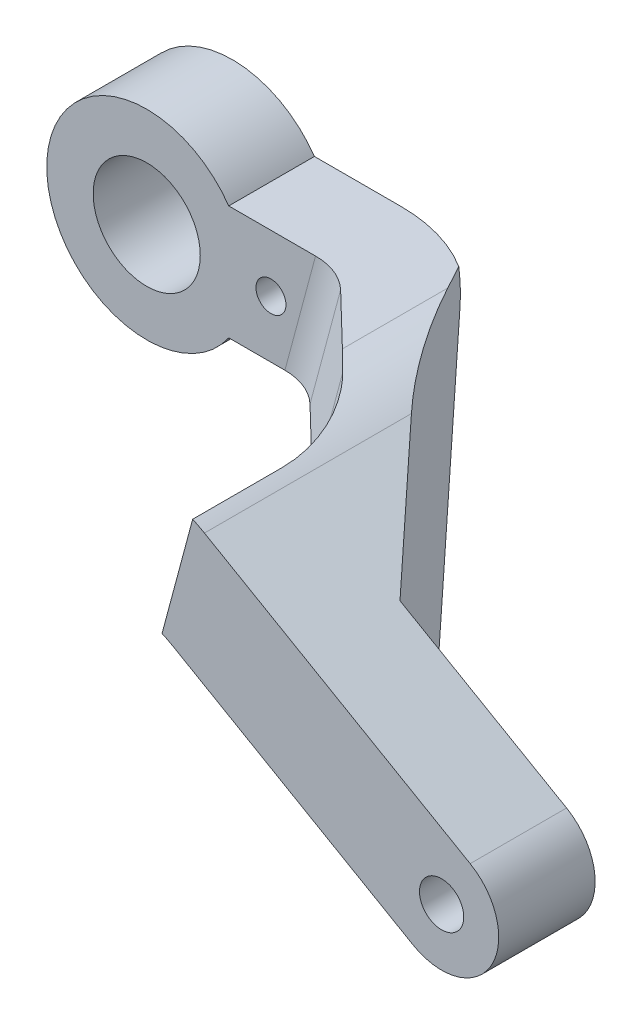
ISO-10303-21;
HEADER;
FILE_DESCRIPTION(('STEP AP214'),'2;1');
FILE_NAME('part.step','',(''),(''),'','','');
FILE_SCHEMA(('AUTOMOTIVE_DESIGN { 1 0 10303 214 1 1 1 1 }'));
ENDSEC;
DATA;
#1=APPLICATION_CONTEXT('core data for automotive mechanical design processes');
#2=APPLICATION_PROTOCOL_DEFINITION('international standard','automotive_design',2000,#1);
#3=PRODUCT_CONTEXT('',#1,'mechanical');
#4=PRODUCT('Part','Part','',(#3));
#5=PRODUCT_RELATED_PRODUCT_CATEGORY('part','',(#4));
#6=PRODUCT_DEFINITION_FORMATION('','',#4);
#7=PRODUCT_DEFINITION_CONTEXT('part definition',#1,'design');
#8=PRODUCT_DEFINITION('design','',#6,#7);
#9=PRODUCT_DEFINITION_SHAPE('','',#8);
#10=(LENGTH_UNIT() NAMED_UNIT(*) SI_UNIT(.MILLI.,.METRE.));
#11=(NAMED_UNIT(*) PLANE_ANGLE_UNIT() SI_UNIT($,.RADIAN.));
#12=(NAMED_UNIT(*) SI_UNIT($,.STERADIAN.) SOLID_ANGLE_UNIT());
#13=UNCERTAINTY_MEASURE_WITH_UNIT(LENGTH_MEASURE(1.E-05),#10,'distance_accuracy_value','');
#14=(GEOMETRIC_REPRESENTATION_CONTEXT(3) GLOBAL_UNCERTAINTY_ASSIGNED_CONTEXT((#13)) GLOBAL_UNIT_ASSIGNED_CONTEXT((#10,
#11,#12)) REPRESENTATION_CONTEXT('',''));
#15=CARTESIAN_POINT('',(0.,0.,0.));
#16=DIRECTION('',(0.,0.,1.));
#17=DIRECTION('',(1.,0.,0.));
#18=AXIS2_PLACEMENT_3D('',#15,#16,#17);
#19=CARTESIAN_POINT('',(0.,0.,-25.35));
#20=DIRECTION('',(0.,0.,-1.));
#21=DIRECTION('',(1.,0.,0.));
#22=AXIS2_PLACEMENT_3D('',#19,#20,#21);
#23=PLANE('',#22);
#24=CARTESIAN_POINT('',(40.,-11.5470053837925,-25.35));
#25=DIRECTION('',(0.,0.,-1.));
#26=DIRECTION('',(-1.,0.,0.));
#27=AXIS2_PLACEMENT_3D('',#24,#25,#26);
#28=CIRCLE('',#27,1.55);
#29=CARTESIAN_POINT('',(38.45,-11.5470053837925,-25.35));
#30=VERTEX_POINT('',#29);
#31=EDGE_CURVE('E512',#30,#30,#28,.T.);
#32=ORIENTED_EDGE('',*,*,#31,.T.);
#33=EDGE_LOOP('',(#32));
#34=FACE_BOUND('',#33,.T.);
#35=DIRECTION('',(-0.258819045102521,-0.965925826289068,0.));
#36=VECTOR('',#35,1.);
#37=CARTESIAN_POINT('',(17.8819508450437,-14.4014203161296,-25.35));
#38=LINE('',#37,#36);
#39=CARTESIAN_POINT('',(22.5678321839119,3.08652691876553,-25.35));
#40=VERTEX_POINT('',#39);
#41=CARTESIAN_POINT('',(20.4242386444629,-4.91347308123447,-25.35));
#42=VERTEX_POINT('',#41);
#43=EDGE_CURVE('E282',#40,#42,#38,.T.);
#44=ORIENTED_EDGE('',*,*,#43,.T.);
#45=CARTESIAN_POINT('',(16.2487113059643,-14.,-25.35));
#46=DIRECTION('',(0.,0.,1.));
#47=DIRECTION('',(1.,0.,0.));
#48=AXIS2_PLACEMENT_3D('',#45,#46,#47);
#49=CIRCLE('',#48,10.);
#50=CARTESIAN_POINT('',(21.2487113059643,-5.33974596215562,-25.35));
#51=VERTEX_POINT('',#50);
#52=EDGE_CURVE('E330',#51,#42,#49,.T.);
#53=ORIENTED_EDGE('',*,*,#52,.F.);
#54=DIRECTION('',(-0.866025403784438,0.500000000000001,0.));
#55=VECTOR('',#54,1.);
#56=CARTESIAN_POINT('',(3.00000000000002,5.19615242270665,-25.35));
#57=LINE('',#56,#55);
#58=CARTESIAN_POINT('',(38.,-15.0111069989303,-25.35));
#59=VERTEX_POINT('',#58);
#60=EDGE_CURVE('E288',#59,#51,#57,.T.);
#61=ORIENTED_EDGE('',*,*,#60,.F.);
#62=CARTESIAN_POINT('',(40.,-11.5470053837925,-25.35));
#63=DIRECTION('',(0.,0.,1.));
#64=DIRECTION('',(1.,0.,0.));
#65=AXIS2_PLACEMENT_3D('',#62,#63,#64);
#66=CIRCLE('',#65,4.);
#67=CARTESIAN_POINT('',(42.,-8.0829037686548,-25.35));
#68=VERTEX_POINT('',#67);
#69=EDGE_CURVE('E292',#68,#59,#66,.F.);
#70=ORIENTED_EDGE('',*,*,#69,.F.);
#71=DIRECTION('',(-0.866025403784438,0.500000000000001,0.));
#72=VECTOR('',#71,1.);
#73=CARTESIAN_POINT('',(7.00000000000003,12.1243556529822,-25.35));
#74=LINE('',#73,#72);
#75=CARTESIAN_POINT('',(23.3923048454133,2.66025403784438,-25.35));
#76=VERTEX_POINT('',#75);
#77=EDGE_CURVE('E287',#68,#76,#74,.T.);
#78=ORIENTED_EDGE('',*,*,#77,.T.);
#79=CARTESIAN_POINT('',(18.3923048454133,-6.,-25.35));
#80=DIRECTION('',(0.,0.,1.));
#81=DIRECTION('',(1.,0.,0.));
#82=AXIS2_PLACEMENT_3D('',#79,#80,#81);
#83=CIRCLE('',#82,10.);
#84=EDGE_CURVE('E319',#40,#76,#83,.F.);
#85=ORIENTED_EDGE('',*,*,#84,.F.);
#86=EDGE_LOOP('',(#44,#53,#61,#70,#78,#85));
#87=FACE_BOUND('',#86,.T.);
#88=ADVANCED_FACE('F41',(#34,#87),#23,.F.);
#89=CARTESIAN_POINT('',(14.3,0.,-47.85));
#90=DIRECTION('',(0.,0.,-1.));
#91=DIRECTION('',(1.,0.,0.));
#92=AXIS2_PLACEMENT_3D('',#89,#90,#91);
#93=PLANE('',#92);
#94=CARTESIAN_POINT('',(8.7,0.,-47.85));
#95=DIRECTION('',(0.,0.,1.));
#96=DIRECTION('',(1.,0.,0.));
#97=AXIS2_PLACEMENT_3D('',#94,#95,#96);
#98=CIRCLE('',#97,1.05);
#99=CARTESIAN_POINT('',(9.75,0.,-47.85));
#100=VERTEX_POINT('',#99);
#101=EDGE_CURVE('E517',#100,#100,#98,.T.);
#102=ORIENTED_EDGE('',*,*,#101,.T.);
#103=EDGE_LOOP('',(#102));
#104=FACE_BOUND('',#103,.T.);
#105=CARTESIAN_POINT('',(14.3,0.,-47.85));
#106=DIRECTION('',(0.,0.,1.));
#107=DIRECTION('',(1.,0.,0.));
#108=AXIS2_PLACEMENT_3D('',#105,#106,#107);
#109=CIRCLE('',#108,2.1);
#110=CARTESIAN_POINT('',(14.4476588758594,-2.09480234303381,-47.85));
#111=VERTEX_POINT('',#110);
#112=CARTESIAN_POINT('',(14.4476588758594,2.09480234303381,-47.85));
#113=VERTEX_POINT('',#112);
#114=EDGE_CURVE('E207',#111,#113,#109,.T.);
#115=ORIENTED_EDGE('',*,*,#114,.F.);
#116=DIRECTION('',(-0.997524925254196,-0.0703137504092332,0.));
#117=VECTOR('',#116,1.);
#118=CARTESIAN_POINT('',(0.21835841186094,-3.09780031931858,-47.85));
#119=LINE('',#118,#117);
#120=CARTESIAN_POINT('',(2.31516738055804,-2.95,-47.85));
#121=VERTEX_POINT('',#120);
#122=EDGE_CURVE('E201',#111,#121,#119,.T.);
#123=ORIENTED_EDGE('',*,*,#122,.T.);
#124=CARTESIAN_POINT('',(0.,0.,-47.85));
#125=DIRECTION('',(0.,0.,1.));
#126=DIRECTION('',(1.,0.,0.));
#127=AXIS2_PLACEMENT_3D('',#124,#125,#126);
#128=CIRCLE('',#127,3.75);
#129=CARTESIAN_POINT('',(2.31516738055804,2.95,-47.85));
#130=VERTEX_POINT('',#129);
#131=EDGE_CURVE('E209',#121,#130,#128,.T.);
#132=ORIENTED_EDGE('',*,*,#131,.T.);
#133=DIRECTION('',(-0.997524925254196,0.0703137504092331,0.));
#134=VECTOR('',#133,1.);
#135=CARTESIAN_POINT('',(0.21835841186094,3.09780031931858,-47.85));
#136=LINE('',#135,#134);
#137=EDGE_CURVE('E193',#113,#130,#136,.T.);
#138=ORIENTED_EDGE('',*,*,#137,.F.);
#139=EDGE_LOOP('',(#115,#123,#132,#138));
#140=FACE_BOUND('',#139,.T.);
#141=ADVANCED_FACE('F205',(#104,#140),#93,.T.);
#142=CARTESIAN_POINT('',(0.21835841186094,3.09780031931858,-47.85));
#143=DIRECTION('',(0.0703137504092331,0.997524925254195,0.));
#144=DIRECTION('',(-0.997524925254195,0.0703137504092331,0.));
#145=AXIS2_PLACEMENT_3D('',#142,#143,#144);
#146=PLANE('',#145);
#147=DIRECTION('',(0.,0.,-1.));
#148=VECTOR('',#147,1.);
#149=CARTESIAN_POINT('',(14.4476588758594,2.09480234303381,-47.85));
#150=LINE('',#149,#148);
#151=CARTESIAN_POINT('',(14.4476588758594,2.09480234303381,-50.2299978366975));
#152=VERTEX_POINT('',#151);
#153=EDGE_CURVE('E189',#113,#152,#150,.T.);
#154=ORIENTED_EDGE('',*,*,#153,.F.);
#155=ORIENTED_EDGE('',*,*,#137,.T.);
#156=DIRECTION('',(0.,0.,-1.));
#157=VECTOR('',#156,1.);
#158=CARTESIAN_POINT('',(2.31516738055804,2.95,-47.85));
#159=LINE('',#158,#157);
#160=CARTESIAN_POINT('',(2.31516738055804,2.95,-50.7));
#161=VERTEX_POINT('',#160);
#162=EDGE_CURVE('E200',#130,#161,#159,.T.);
#163=ORIENTED_EDGE('',*,*,#162,.T.);
#164=DIRECTION('',(-0.997524925254196,0.0703137504092331,0.));
#165=VECTOR('',#164,1.);
#166=CARTESIAN_POINT('',(0.21835841186094,3.09780031931858,-50.7));
#167=LINE('',#166,#165);
#168=CARTESIAN_POINT('',(11.3692158806194,2.31179629169249,-50.7));
#169=VERTEX_POINT('',#168);
#170=EDGE_CURVE('E218',#169,#161,#167,.T.);
#171=ORIENTED_EDGE('',*,*,#170,.F.);
#172=CARTESIAN_POINT('',(11.3692158806194,2.31179629169249,-40.7));
#173=DIRECTION('',(-0.0703137504092331,-0.997524925254195,0.));
#174=DIRECTION('',(0.997524925254196,-0.0703137504092331,0.));
#175=AXIS2_PLACEMENT_3D('',#172,#173,#174);
#176=ELLIPSE('',#175,10.1860624319942,10.);
#177=EDGE_CURVE('E197',#152,#169,#176,.F.);
#178=ORIENTED_EDGE('',*,*,#177,.F.);
#179=EDGE_LOOP('',(#154,#155,#163,#171,#178));
#180=FACE_BOUND('',#179,.T.);
#181=ADVANCED_FACE('F191',(#180),#146,.F.);
#182=CARTESIAN_POINT('',(0.21835841186094,-3.09780031931858,-47.85));
#183=DIRECTION('',(-0.0703137504092331,0.997524925254195,0.));
#184=DIRECTION('',(-0.997524925254195,-0.0703137504092331,0.));
#185=AXIS2_PLACEMENT_3D('',#182,#183,#184);
#186=PLANE('',#185);
#187=DIRECTION('',(-0.997524925254196,-0.0703137504092332,0.));
#188=VECTOR('',#187,1.);
#189=CARTESIAN_POINT('',(0.21835841186094,-3.09780031931858,-50.7));
#190=LINE('',#189,#188);
#191=CARTESIAN_POINT('',(10.106478329303,-2.40080440644511,-50.7));
#192=VERTEX_POINT('',#191);
#193=CARTESIAN_POINT('',(2.31516738055804,-2.95,-50.7));
#194=VERTEX_POINT('',#193);
#195=EDGE_CURVE('E215',#192,#194,#190,.T.);
#196=ORIENTED_EDGE('',*,*,#195,.T.);
#197=DIRECTION('',(0.,0.,-1.));
#198=VECTOR('',#197,1.);
#199=CARTESIAN_POINT('',(2.31516738055804,-2.95,-47.85));
#200=LINE('',#199,#198);
#201=EDGE_CURVE('E230',#121,#194,#200,.T.);
#202=ORIENTED_EDGE('',*,*,#201,.F.);
#203=ORIENTED_EDGE('',*,*,#122,.F.);
#204=DIRECTION('',(0.,0.,-1.));
#205=VECTOR('',#204,1.);
#206=CARTESIAN_POINT('',(14.4476588758594,-2.09480234303381,-47.85));
#207=LINE('',#206,#205);
#208=CARTESIAN_POINT('',(14.4476588758594,-2.09480234303381,-49.8145222876189));
#209=VERTEX_POINT('',#208);
#210=EDGE_CURVE('E213',#111,#209,#207,.T.);
#211=ORIENTED_EDGE('',*,*,#210,.T.);
#212=CARTESIAN_POINT('',(10.106478329303,-2.40080440644511,-40.7));
#213=DIRECTION('',(0.0703137504092331,-0.997524925254195,0.));
#214=DIRECTION('',(0.997524925254196,0.0703137504092331,0.));
#215=AXIS2_PLACEMENT_3D('',#212,#213,#214);
#216=ELLIPSE('',#215,10.5782432729629,10.);
#217=EDGE_CURVE('E376',#192,#209,#216,.T.);
#218=ORIENTED_EDGE('',*,*,#217,.F.);
#219=EDGE_LOOP('',(#196,#202,#203,#211,#218));
#220=FACE_BOUND('',#219,.T.);
#221=ADVANCED_FACE('F390',(#220),#186,.T.);
#222=CARTESIAN_POINT('',(0.,0.,-40.7));
#223=DIRECTION('',(0.,0.,-1.));
#224=DIRECTION('',(1.,0.,0.));
#225=AXIS2_PLACEMENT_3D('',#222,#223,#224);
#226=CYLINDRICAL_SURFACE('',#225,3.75);
#227=CARTESIAN_POINT('',(0.,0.,-44.7));
#228=DIRECTION('',(0.,0.,1.));
#229=DIRECTION('',(1.,0.,0.));
#230=AXIS2_PLACEMENT_3D('',#227,#228,#229);
#231=CIRCLE('',#230,3.75);
#232=CARTESIAN_POINT('',(3.75,0.,-44.7));
#233=VERTEX_POINT('',#232);
#234=EDGE_CURVE('E235',#233,#233,#231,.T.);
#235=ORIENTED_EDGE('',*,*,#234,.T.);
#236=EDGE_LOOP('',(#235));
#237=FACE_BOUND('',#236,.T.);
#238=ORIENTED_EDGE('',*,*,#201,.T.);
#239=CARTESIAN_POINT('',(0.,0.,-50.7));
#240=DIRECTION('',(0.,0.,1.));
#241=DIRECTION('',(1.,0.,0.));
#242=AXIS2_PLACEMENT_3D('',#239,#240,#241);
#243=CIRCLE('',#242,3.75);
#244=EDGE_CURVE('E229',#161,#194,#243,.T.);
#245=ORIENTED_EDGE('',*,*,#244,.F.);
#246=ORIENTED_EDGE('',*,*,#162,.F.);
#247=ORIENTED_EDGE('',*,*,#131,.F.);
#248=EDGE_LOOP('',(#238,#245,#246,#247));
#249=FACE_BOUND('',#248,.T.);
#250=ADVANCED_FACE('F386',(#237,#249),#226,.F.);
#251=CARTESIAN_POINT('',(8.7,0.,-37.85));
#252=DIRECTION('',(0.,0.,-1.));
#253=DIRECTION('',(1.,0.,0.));
#254=AXIS2_PLACEMENT_3D('',#251,#252,#253);
#255=CYLINDRICAL_SURFACE('',#254,1.05);
#256=ORIENTED_EDGE('',*,*,#101,.F.);
#257=EDGE_LOOP('',(#256));
#258=FACE_BOUND('',#257,.T.);
#259=CARTESIAN_POINT('',(8.7,0.,-44.7));
#260=DIRECTION('',(0.,0.,1.));
#261=DIRECTION('',(1.,0.,0.));
#262=AXIS2_PLACEMENT_3D('',#259,#260,#261);
#263=CIRCLE('',#262,1.05);
#264=CARTESIAN_POINT('',(9.75,0.,-44.7));
#265=VERTEX_POINT('',#264);
#266=EDGE_CURVE('E221',#265,#265,#263,.T.);
#267=ORIENTED_EDGE('',*,*,#266,.T.);
#268=EDGE_LOOP('',(#267));
#269=FACE_BOUND('',#268,.T.);
#270=ADVANCED_FACE('F389',(#258,#269),#255,.F.);
#271=CARTESIAN_POINT('',(0.,0.,-1.69999999999997));
#272=DIRECTION('',(0.,0.,-1.));
#273=DIRECTION('',(1.,0.,0.));
#274=AXIS2_PLACEMENT_3D('',#271,#272,#273);
#275=CYLINDRICAL_SURFACE('',#274,7.);
#276=DIRECTION('',(0.,0.,-1.));
#277=VECTOR('',#276,1.);
#278=CARTESIAN_POINT('',(5.74456264653803,4.,-1.69999999999997));
#279=LINE('',#278,#277);
#280=CARTESIAN_POINT('',(5.74456264653803,4.,-44.7));
#281=VERTEX_POINT('',#280);
#282=CARTESIAN_POINT('',(5.74456264653803,4.,-50.7));
#283=VERTEX_POINT('',#282);
#284=EDGE_CURVE('E272',#281,#283,#279,.T.);
#285=ORIENTED_EDGE('',*,*,#284,.T.);
#286=CARTESIAN_POINT('',(0.,0.,-50.7));
#287=DIRECTION('',(0.,0.,1.));
#288=DIRECTION('',(1.,0.,0.));
#289=AXIS2_PLACEMENT_3D('',#286,#287,#288);
#290=CIRCLE('',#289,7.);
#291=CARTESIAN_POINT('',(5.74456264653803,-4.,-50.7));
#292=VERTEX_POINT('',#291);
#293=EDGE_CURVE('E261',#283,#292,#290,.T.);
#294=ORIENTED_EDGE('',*,*,#293,.T.);
#295=DIRECTION('',(0.,0.,-1.));
#296=VECTOR('',#295,1.);
#297=CARTESIAN_POINT('',(5.74456264653803,-4.,-1.69999999999997));
#298=LINE('',#297,#296);
#299=CARTESIAN_POINT('',(5.74456264653803,-4.,-44.7));
#300=VERTEX_POINT('',#299);
#301=EDGE_CURVE('E268',#300,#292,#298,.T.);
#302=ORIENTED_EDGE('',*,*,#301,.F.);
#303=CARTESIAN_POINT('',(0.,0.,-44.7));
#304=DIRECTION('',(0.,0.,1.));
#305=DIRECTION('',(1.,0.,0.));
#306=AXIS2_PLACEMENT_3D('',#303,#304,#305);
#307=CIRCLE('',#306,7.);
#308=EDGE_CURVE('E253',#300,#281,#307,.F.);
#309=ORIENTED_EDGE('',*,*,#308,.T.);
#310=EDGE_LOOP('',(#285,#294,#302,#309));
#311=FACE_BOUND('',#310,.T.);
#312=ADVANCED_FACE('F384',(#311),#275,.T.);
#313=CARTESIAN_POINT('',(14.3,0.,-47.85));
#314=DIRECTION('',(0.,0.,-1.));
#315=DIRECTION('',(1.,0.,0.));
#316=AXIS2_PLACEMENT_3D('',#313,#314,#315);
#317=CYLINDRICAL_SURFACE('',#316,2.1);
#318=ORIENTED_EDGE('',*,*,#210,.F.);
#319=ORIENTED_EDGE('',*,*,#114,.T.);
#320=ORIENTED_EDGE('',*,*,#153,.T.);
#321=CARTESIAN_POINT('',(14.4476588758594,-2.09480234303381,-49.8145222876189));
#322=CARTESIAN_POINT('',(14.5110638418506,-2.09032718876905,-49.7874039258142));
#323=CARTESIAN_POINT('',(14.5741253856427,-2.08299398658678,-49.7600472211586));
#324=CARTESIAN_POINT('',(14.6992478739881,-2.06267465132273,-49.7051303069145));
#325=CARTESIAN_POINT('',(14.7613087331593,-2.04968803849029,-49.6775700802502));
#326=CARTESIAN_POINT('',(14.9460113863559,-2.00221417464057,-49.5947732764114));
#327=CARTESIAN_POINT('',(15.0666433708133,-1.9592507862644,-49.5396494915121));
#328=CARTESIAN_POINT('',(15.2994171277795,-1.85139619486452,-49.4326238426666));
#329=CARTESIAN_POINT('',(15.4115474060476,-1.78647593139323,-49.3807263571299));
#330=CARTESIAN_POINT('',(15.6236670646593,-1.63547246290233,-49.2837569971516));
#331=CARTESIAN_POINT('',(15.7236859295596,-1.54944226140477,-49.2386684776585));
#332=CARTESIAN_POINT('',(15.8870185410784,-1.37913144972467,-49.1681839093816));
#333=CARTESIAN_POINT('',(15.953530651556,-1.29879830795271,-49.1406394386909));
#334=CARTESIAN_POINT('',(16.0747720763172,-1.12746227901934,-49.0939679120562));
#335=CARTESIAN_POINT('',(16.1295087416943,-1.036466103637,-49.0748355967969));
#336=CARTESIAN_POINT('',(16.2252611617978,-0.845475224971784,-49.046584203409));
#337=CARTESIAN_POINT('',(16.2662106115561,-0.745439891393311,-49.0375130451224));
#338=CARTESIAN_POINT('',(16.3322767250431,-0.539900150973491,-49.0304730288112));
#339=CARTESIAN_POINT('',(16.357397518582,-0.434397178459478,-49.0325012735338));
#340=CARTESIAN_POINT('',(16.3896859212667,-0.230262783844825,-49.0468195251683));
#341=CARTESIAN_POINT('',(16.398148002961,-0.131770728836464,-49.0582611425611));
#342=CARTESIAN_POINT('',(16.4013068809453,0.0641047844770843,-49.0893616147542));
#343=CARTESIAN_POINT('',(16.3960011942506,0.161488039631642,-49.1090219512446));
#344=CARTESIAN_POINT('',(16.3718637976183,0.357086133414158,-49.1561603354448));
#345=CARTESIAN_POINT('',(16.3524588866797,0.455155863816123,-49.1839388452329));
#346=CARTESIAN_POINT('',(16.3006440120909,0.645914934387876,-49.2451739662766));
#347=CARTESIAN_POINT('',(16.2682282267821,0.738601844758898,-49.2786331154374));
#348=CARTESIAN_POINT('',(16.186087423663,0.930063210084563,-49.3546317210029));
#349=CARTESIAN_POINT('',(16.1345514768037,1.02781643330133,-49.3977855405314));
#350=CARTESIAN_POINT('',(16.0176521371022,1.21313191494271,-49.4871260275085));
#351=CARTESIAN_POINT('',(15.9522814522584,1.30068876119187,-49.5333142854583));
#352=CARTESIAN_POINT('',(15.7994872957533,1.47538163460228,-49.6331479977379));
#353=CARTESIAN_POINT('',(15.7102788435291,1.56086929469766,-49.6869592600249));
#354=CARTESIAN_POINT('',(15.5178842627748,1.71521963787836,-49.7937210927752));
#355=CARTESIAN_POINT('',(15.4146856775065,1.78406735106158,-49.8466708485561));
#356=CARTESIAN_POINT('',(15.1921670016923,1.90545409448161,-49.9517536401844));
#357=CARTESIAN_POINT('',(15.0723598829231,1.95721010062044,-50.003764502547));
#358=CARTESIAN_POINT('',(14.823534943806,2.03786900869596,-50.1025630684655));
#359=CARTESIAN_POINT('',(14.6945453559902,2.06683891858088,-50.149365736807));
#360=CARTESIAN_POINT('',(14.5248063430596,2.08829375506303,-50.2055243240933));
#361=CARTESIAN_POINT('',(14.4863085571081,2.0920852055504,-50.2179113322592));
#362=CARTESIAN_POINT('',(14.4476588758594,2.09480234303381,-50.2299978366975));
#363=B_SPLINE_CURVE_WITH_KNOTS('',3,(#321,#322,#323,#324,#325,#326,#327,#328,#329,#330,#331,
#332,#333,#334,#335,#336,#337,#338,#339,#340,#341,#342,#343,#344,#345,#346,#347,#348,#349,#350,
#351,#352,#353,#354,#355,#356,#357,#358,#359,#360,#361,#362),.UNSPECIFIED.,.F.,.F.,(4,2,2,2,2,2,
2,2,2,2,2,2,2,2,2,2,2,2,2,2,4),(0.,0.207185845459153,0.414389276219697,0.83051021859232,
1.24718407630737,1.6628222529011,1.98510111819791,2.30717820586969,2.63078279954972,
2.95430292746622,3.25149942096883,3.54874951688516,3.85881303201607,4.16901543864523,
4.5235219989365,4.87821587967857,5.28073196789138,5.6836088374729,6.10297860666666,
6.52111045949849,6.64290480646933),.UNSPECIFIED.);
#364=EDGE_CURVE('E368',#209,#152,#363,.T.);
#365=ORIENTED_EDGE('',*,*,#364,.F.);
#366=EDGE_LOOP('',(#318,#319,#320,#365));
#367=FACE_BOUND('',#366,.T.);
#368=ADVANCED_FACE('F211',(#367),#317,.F.);
#369=CARTESIAN_POINT('',(0.,0.,-50.7));
#370=DIRECTION('',(0.,0.,-1.));
#371=DIRECTION('',(1.,0.,0.));
#372=AXIS2_PLACEMENT_3D('',#369,#370,#371);
#373=PLANE('',#372);
#374=DIRECTION('',(1.,0.,0.));
#375=VECTOR('',#374,1.);
#376=CARTESIAN_POINT('',(0.,-4.,-50.7));
#377=LINE('',#376,#375);
#378=CARTESIAN_POINT('',(9.6779751614706,-4.,-50.7));
#379=VERTEX_POINT('',#378);
#380=EDGE_CURVE('E264',#292,#379,#377,.T.);
#381=ORIENTED_EDGE('',*,*,#380,.F.);
#382=ORIENTED_EDGE('',*,*,#293,.F.);
#383=DIRECTION('',(1.,0.,0.));
#384=VECTOR('',#383,1.);
#385=CARTESIAN_POINT('',(0.,4.,-50.7));
#386=LINE('',#385,#384);
#387=CARTESIAN_POINT('',(11.8215687009196,4.,-50.7));
#388=VERTEX_POINT('',#387);
#389=EDGE_CURVE('E258',#283,#388,#386,.T.);
#390=ORIENTED_EDGE('',*,*,#389,.T.);
#391=DIRECTION('',(-0.258819045102521,-0.965925826289068,0.));
#392=VECTOR('',#391,1.);
#393=CARTESIAN_POINT('',(12.1088272732426,5.07206358681918,-50.7));
#394=LINE('',#393,#392);
#395=EDGE_CURVE('E479',#169,#388,#394,.F.);
#396=ORIENTED_EDGE('',*,*,#395,.F.);
#397=ORIENTED_EDGE('',*,*,#170,.T.);
#398=ORIENTED_EDGE('',*,*,#244,.T.);
#399=ORIENTED_EDGE('',*,*,#195,.F.);
#400=DIRECTION('',(0.258819045102521,0.965925826289068,0.));
#401=VECTOR('',#400,1.);
#402=CARTESIAN_POINT('',(9.89222674538682,-3.20040220322255,-50.7));
#403=LINE('',#402,#401);
#404=EDGE_CURVE('E476',#379,#192,#403,.T.);
#405=ORIENTED_EDGE('',*,*,#404,.F.);
#406=EDGE_LOOP('',(#381,#382,#390,#396,#397,#398,#399,#405));
#407=FACE_BOUND('',#406,.T.);
#408=ADVANCED_FACE('F383',(#407),#373,.T.);
#409=CARTESIAN_POINT('',(-9.16397229105025,-7.154487053259,-44.7));
#410=DIRECTION('',(0.,0.,-1.));
#411=DIRECTION('',(1.,0.,0.));
#412=AXIS2_PLACEMENT_3D('',#409,#410,#411);
#413=PLANE('',#412);
#414=ORIENTED_EDGE('',*,*,#266,.F.);
#415=EDGE_LOOP('',(#414));
#416=FACE_BOUND('',#415,.T.);
#417=ORIENTED_EDGE('',*,*,#234,.F.);
#418=EDGE_LOOP('',(#417));
#419=FACE_BOUND('',#418,.T.);
#420=DIRECTION('',(-1.,0.,0.));
#421=VECTOR('',#420,1.);
#422=CARTESIAN_POINT('',(0.,4.,-44.7));
#423=LINE('',#422,#421);
#424=CARTESIAN_POINT('',(11.8215687009196,4.,-44.7));
#425=VERTEX_POINT('',#424);
#426=EDGE_CURVE('E280',#425,#281,#423,.T.);
#427=ORIENTED_EDGE('',*,*,#426,.T.);
#428=ORIENTED_EDGE('',*,*,#308,.F.);
#429=DIRECTION('',(-1.,0.,0.));
#430=VECTOR('',#429,1.);
#431=CARTESIAN_POINT('',(0.,-4.,-44.7));
#432=LINE('',#431,#430);
#433=CARTESIAN_POINT('',(9.6779751614706,-4.,-44.7));
#434=VERTEX_POINT('',#433);
#435=EDGE_CURVE('E256',#434,#300,#432,.T.);
#436=ORIENTED_EDGE('',*,*,#435,.F.);
#437=DIRECTION('',(0.258819045102521,0.965925826289068,0.));
#438=VECTOR('',#437,1.);
#439=CARTESIAN_POINT('',(9.79287859039981,-3.57117456527233,-44.7));
#440=LINE('',#439,#438);
#441=EDGE_CURVE('E464',#425,#434,#440,.F.);
#442=ORIENTED_EDGE('',*,*,#441,.F.);
#443=EDGE_LOOP('',(#427,#428,#436,#442));
#444=FACE_BOUND('',#443,.T.);
#445=ADVANCED_FACE('F392',(#416,#419,#444),#413,.F.);
#446=CARTESIAN_POINT('',(0.,4.,-1.69999999999997));
#447=DIRECTION('',(0.,-1.,0.));
#448=DIRECTION('',(0.,0.,1.));
#449=AXIS2_PLACEMENT_3D('',#446,#447,#448);
#450=PLANE('',#449);
#451=ORIENTED_EDGE('',*,*,#389,.F.);
#452=ORIENTED_EDGE('',*,*,#284,.F.);
#453=ORIENTED_EDGE('',*,*,#426,.F.);
#454=CARTESIAN_POINT('',(11.8215687009196,4.,-40.7));
#455=DIRECTION('',(0.,1.,0.));
#456=DIRECTION('',(-1.,0.,0.));
#457=AXIS2_PLACEMENT_3D('',#454,#455,#456);
#458=ELLIPSE('',#457,4.14110472164033,4.);
#459=CARTESIAN_POINT('',(14.7497719311951,4.,-43.5284271247462));
#460=VERTEX_POINT('',#459);
#461=EDGE_CURVE('E49',#460,#425,#458,.T.);
#462=ORIENTED_EDGE('',*,*,#461,.F.);
#463=DIRECTION('',(-0.719254596676403,0.,-0.694746590606866));
#464=VECTOR('',#463,1.);
#465=CARTESIAN_POINT('',(28.0209656882436,4.,-30.7094383291268));
#466=LINE('',#465,#464);
#467=CARTESIAN_POINT('',(18.3923048454133,4.,-40.0100105097948));
#468=VERTEX_POINT('',#467);
#469=EDGE_CURVE('E248',#468,#460,#466,.T.);
#470=ORIENTED_EDGE('',*,*,#469,.F.);
#471=DIRECTION('',(0.,0.,-1.));
#472=VECTOR('',#471,1.);
#473=CARTESIAN_POINT('',(18.3923048454133,4.,-1.69999999999997));
#474=LINE('',#473,#472);
#475=CARTESIAN_POINT('',(18.3923048454133,4.,-47.387965278581));
#476=VERTEX_POINT('',#475);
#477=EDGE_CURVE('E311',#476,#468,#474,.F.);
#478=ORIENTED_EDGE('',*,*,#477,.F.);
#479=DIRECTION('',(-0.475576474947911,0.,-0.879674380936559));
#480=VECTOR('',#479,1.);
#481=CARTESIAN_POINT('',(28.2400583557509,4.,-29.1725636993272));
#482=LINE('',#481,#480);
#483=CARTESIAN_POINT('',(17.4810445215168,4.,-49.0735246018917));
#484=VERTEX_POINT('',#483);
#485=EDGE_CURVE('E301',#484,#476,#482,.F.);
#486=ORIENTED_EDGE('',*,*,#485,.F.);
#487=CARTESIAN_POINT('',(11.8215687009196,4.,-40.7));
#488=DIRECTION('',(0.,1.,0.));
#489=DIRECTION('',(1.,0.,0.));
#490=AXIS2_PLACEMENT_3D('',#487,#488,#489);
#491=ELLIPSE('',#490,10.3527618041008,10.);
#492=EDGE_CURVE('E489',#388,#484,#491,.F.);
#493=ORIENTED_EDGE('',*,*,#492,.F.);
#494=EDGE_LOOP('',(#451,#452,#453,#462,#470,#478,#486,#493));
#495=FACE_BOUND('',#494,.T.);
#496=ADVANCED_FACE('F395',(#495),#450,.F.);
#497=CARTESIAN_POINT('',(0.,-4.,-1.69999999999997));
#498=DIRECTION('',(0.,-1.,0.));
#499=DIRECTION('',(1.,0.,0.));
#500=AXIS2_PLACEMENT_3D('',#497,#498,#499);
#501=PLANE('',#500);
#502=DIRECTION('',(0.,0.,-1.));
#503=VECTOR('',#502,1.);
#504=CARTESIAN_POINT('',(16.2487113059643,-4.,-45.9071014330082));
#505=LINE('',#504,#503);
#506=CARTESIAN_POINT('',(16.2487113059643,-4.,-40.0100105097948));
#507=VERTEX_POINT('',#506);
#508=CARTESIAN_POINT('',(16.2487113059643,-4.,-48.4277147038346));
#509=VERTEX_POINT('',#508);
#510=EDGE_CURVE('E322',#507,#509,#505,.T.);
#511=ORIENTED_EDGE('',*,*,#510,.F.);
#512=DIRECTION('',(-0.719254596676403,0.,-0.694746590606866));
#513=VECTOR('',#512,1.);
#514=CARTESIAN_POINT('',(26.9863113385633,-4.,-29.6382853259451));
#515=LINE('',#514,#513);
#516=CARTESIAN_POINT('',(12.6061783917461,-4.,-43.5284271247462));
#517=VERTEX_POINT('',#516);
#518=EDGE_CURVE('E251',#507,#517,#515,.T.);
#519=ORIENTED_EDGE('',*,*,#518,.T.);
#520=CARTESIAN_POINT('',(9.6779751614706,-4.,-40.7));
#521=DIRECTION('',(0.,1.,0.));
#522=DIRECTION('',(-1.,0.,0.));
#523=AXIS2_PLACEMENT_3D('',#520,#521,#522);
#524=ELLIPSE('',#523,4.14110472164033,4.);
#525=EDGE_CURVE('E11',#434,#517,#524,.F.);
#526=ORIENTED_EDGE('',*,*,#525,.F.);
#527=ORIENTED_EDGE('',*,*,#435,.T.);
#528=ORIENTED_EDGE('',*,*,#301,.T.);
#529=ORIENTED_EDGE('',*,*,#380,.T.);
#530=CARTESIAN_POINT('',(9.6779751614706,-4.,-40.7));
#531=DIRECTION('',(0.,1.,0.));
#532=DIRECTION('',(1.,0.,0.));
#533=AXIS2_PLACEMENT_3D('',#530,#531,#532);
#534=ELLIPSE('',#533,10.3527618041008,10.);
#535=EDGE_CURVE('E354',#509,#379,#534,.T.);
#536=ORIENTED_EDGE('',*,*,#535,.F.);
#537=EDGE_LOOP('',(#511,#519,#526,#527,#528,#529,#536));
#538=FACE_BOUND('',#537,.T.);
#539=ADVANCED_FACE('F413',(#538),#501,.T.);
#540=CARTESIAN_POINT('',(11.6281780221764,-12.7257269385946,-50.7));
#541=DIRECTION('',(-0.68301270189222,0.18301270189222,0.707106781186547));
#542=DIRECTION('',(-0.719254596676403,0.,-0.694746590606866));
#543=AXIS2_PLACEMENT_3D('',#540,#541,#542);
#544=PLANE('',#543);
#545=DIRECTION('',(-0.622892752510496,0.359627298338203,-0.694746590606866));
#546=VECTOR('',#545,1.);
#547=CARTESIAN_POINT('',(18.3174095589512,3.31984963787445,-48.391599308243));
#548=LINE('',#547,#546);
#549=CARTESIAN_POINT('',(32.9240579011119,-5.11330271443027,-32.1));
#550=VERTEX_POINT('',#549);
#551=CARTESIAN_POINT('',(18.873762878311,2.99863889917749,-47.7710678118654));
#552=VERTEX_POINT('',#551);
#553=EDGE_CURVE('E298',#550,#552,#548,.T.);
#554=ORIENTED_EDGE('',*,*,#553,.F.);
#555=DIRECTION('',(0.258819045102521,0.965925826289068,0.));
#556=VECTOR('',#555,1.);
#557=CARTESIAN_POINT('',(29.5943983911531,-17.5397611775015,-32.1));
#558=LINE('',#557,#556);
#559=CARTESIAN_POINT('',(31.3073117168471,-11.1470816170497,-32.1));
#560=VERTEX_POINT('',#559);
#561=EDGE_CURVE('E236',#560,#550,#558,.T.);
#562=ORIENTED_EDGE('',*,*,#561,.F.);
#563=DIRECTION('',(0.622892752510495,-0.359627298338203,0.694746590606866));
#564=VECTOR('',#563,1.);
#565=CARTESIAN_POINT('',(29.8188496491114,-10.287717641564,-33.7601637162081));
#566=LINE('',#565,#564);
#567=CARTESIAN_POINT('',(21.2487113059643,-5.33974596215562,-43.318910981983));
#568=VERTEX_POINT('',#567);
#569=EDGE_CURVE('E239',#568,#560,#566,.T.);
#570=ORIENTED_EDGE('',*,*,#569,.F.);
#571=CARTESIAN_POINT('',(16.2487113059643,-14.,-45.9071014330082));
#572=DIRECTION('',(0.68301270189222,-0.18301270189222,-0.707106781186547));
#573=DIRECTION('',(0.683012701892219,-0.183012701892219,0.707106781186548));
#574=AXIS2_PLACEMENT_3D('',#571,#572,#573);
#575=ELLIPSE('',#574,14.142135623731,10.);
#576=CARTESIAN_POINT('',(16.9910893584533,-4.02759433099603,-47.7710678118655));
#577=VERTEX_POINT('',#576);
#578=EDGE_CURVE('E327',#577,#568,#575,.T.);
#579=ORIENTED_EDGE('',*,*,#578,.F.);
#580=DIRECTION('',(-0.258819045102521,-0.965925826289068,0.));
#581=VECTOR('',#580,1.);
#582=CARTESIAN_POINT('',(18.3289639995816,0.965421803852829,-47.7710678118654));
#583=LINE('',#582,#581);
#584=EDGE_CURVE('E344',#552,#577,#583,.T.);
#585=ORIENTED_EDGE('',*,*,#584,.F.);
#586=EDGE_LOOP('',(#554,#562,#570,#579,#585));
#587=FACE_BOUND('',#586,.T.);
#588=ADVANCED_FACE('F409',(#587),#544,.F.);
#589=CARTESIAN_POINT('',(29.5943983911531,-17.5397611775015,-32.1));
#590=DIRECTION('',(0.,0.,1.));
#591=DIRECTION('',(-1.,0.,0.));
#592=AXIS2_PLACEMENT_3D('',#589,#590,#591);
#593=PLANE('',#592);
#594=CARTESIAN_POINT('',(40.,-11.5470053837925,-32.1));
#595=DIRECTION('',(0.,0.,-1.));
#596=DIRECTION('',(-1.,0.,0.));
#597=AXIS2_PLACEMENT_3D('',#594,#595,#596);
#598=CIRCLE('',#597,1.55);
#599=CARTESIAN_POINT('',(38.45,-11.5470053837925,-32.1));
#600=VERTEX_POINT('',#599);
#601=EDGE_CURVE('E515',#600,#600,#598,.T.);
#602=ORIENTED_EDGE('',*,*,#601,.F.);
#603=EDGE_LOOP('',(#602));
#604=FACE_BOUND('',#603,.T.);
#605=DIRECTION('',(0.866025403784438,-0.500000000000001,0.));
#606=VECTOR('',#605,1.);
#607=CARTESIAN_POINT('',(3.00000000000002,5.19615242270665,-32.1));
#608=LINE('',#607,#606);
#609=CARTESIAN_POINT('',(38.,-15.0111069989303,-32.1));
#610=VERTEX_POINT('',#609);
#611=EDGE_CURVE('E245',#560,#610,#608,.T.);
#612=ORIENTED_EDGE('',*,*,#611,.F.);
#613=ORIENTED_EDGE('',*,*,#561,.T.);
#614=DIRECTION('',(-0.56660602913241,0.823988839579034,0.));
#615=VECTOR('',#614,1.);
#616=CARTESIAN_POINT('',(37.6567242467955,-11.9957996343197,-32.1));
#617=LINE('',#616,#615);
#618=CARTESIAN_POINT('',(30.3349507982984,-1.34808447194213,-32.1));
#619=VERTEX_POINT('',#618);
#620=EDGE_CURVE('E304',#619,#550,#617,.F.);
#621=ORIENTED_EDGE('',*,*,#620,.F.);
#622=DIRECTION('',(0.866025403784438,-0.500000000000001,0.));
#623=VECTOR('',#622,1.);
#624=CARTESIAN_POINT('',(7.00000000000003,12.1243556529822,-32.1));
#625=LINE('',#624,#623);
#626=CARTESIAN_POINT('',(42.,-8.0829037686548,-32.1));
#627=VERTEX_POINT('',#626);
#628=EDGE_CURVE('E242',#619,#627,#625,.T.);
#629=ORIENTED_EDGE('',*,*,#628,.T.);
#630=CARTESIAN_POINT('',(40.,-11.5470053837925,-32.1));
#631=DIRECTION('',(0.,0.,-1.));
#632=DIRECTION('',(-1.,0.,0.));
#633=AXIS2_PLACEMENT_3D('',#630,#631,#632);
#634=CIRCLE('',#633,4.);
#635=EDGE_CURVE('E271',#610,#627,#634,.F.);
#636=ORIENTED_EDGE('',*,*,#635,.F.);
#637=EDGE_LOOP('',(#612,#613,#621,#629,#636));
#638=FACE_BOUND('',#637,.T.);
#639=ADVANCED_FACE('F412',(#604,#638),#593,.F.);
#640=CARTESIAN_POINT('',(40.,-11.5470053837925,-1.69999999999997));
#641=DIRECTION('',(0.,0.,-1.));
#642=DIRECTION('',(1.,0.,0.));
#643=AXIS2_PLACEMENT_3D('',#640,#641,#642);
#644=CYLINDRICAL_SURFACE('',#643,4.);
#645=ORIENTED_EDGE('',*,*,#69,.T.);
#646=DIRECTION('',(0.,0.,-1.));
#647=VECTOR('',#646,1.);
#648=CARTESIAN_POINT('',(38.,-15.0111069989303,-1.69999999999997));
#649=LINE('',#648,#647);
#650=EDGE_CURVE('E267',#59,#610,#649,.T.);
#651=ORIENTED_EDGE('',*,*,#650,.T.);
#652=ORIENTED_EDGE('',*,*,#635,.T.);
#653=DIRECTION('',(0.,0.,-1.));
#654=VECTOR('',#653,1.);
#655=CARTESIAN_POINT('',(42.,-8.0829037686548,-1.69999999999997));
#656=LINE('',#655,#654);
#657=EDGE_CURVE('E275',#68,#627,#656,.T.);
#658=ORIENTED_EDGE('',*,*,#657,.F.);
#659=EDGE_LOOP('',(#645,#651,#652,#658));
#660=FACE_BOUND('',#659,.T.);
#661=ADVANCED_FACE('F401',(#660),#644,.T.);
#662=CARTESIAN_POINT('',(9.22758055720418,-12.0824887865031,-44.7));
#663=DIRECTION('',(0.68301270189222,-0.18301270189222,-0.707106781186547));
#664=DIRECTION('',(0.719254596676403,0.,0.694746590606866));
#665=AXIS2_PLACEMENT_3D('',#662,#663,#664);
#666=PLANE('',#665);
#667=ORIENTED_EDGE('',*,*,#518,.F.);
#668=CARTESIAN_POINT('',(16.2487113059643,-14.,-37.4218200587696));
#669=DIRECTION('',(-0.68301270189222,0.18301270189222,0.707106781186547));
#670=DIRECTION('',(0.683012701892219,-0.183012701892219,0.707106781186548));
#671=AXIS2_PLACEMENT_3D('',#668,#669,#670);
#672=ELLIPSE('',#671,14.142135623731,10.);
#673=CARTESIAN_POINT('',(17.6117420873147,-4.09332815275022,-38.6692687726855));
#674=VERTEX_POINT('',#673);
#675=EDGE_CURVE('E336',#674,#507,#672,.T.);
#676=ORIENTED_EDGE('',*,*,#675,.F.);
#677=DIRECTION('',(0.258819045102521,0.965925826289068,0.));
#678=VECTOR('',#677,1.);
#679=CARTESIAN_POINT('',(17.5951074004944,-4.15540964913146,-38.6692687726855));
#680=LINE('',#679,#678);
#681=CARTESIAN_POINT('',(19.7553356267637,3.90667184724978,-38.6692687726855));
#682=VERTEX_POINT('',#681);
#683=EDGE_CURVE('E341',#682,#674,#680,.F.);
#684=ORIENTED_EDGE('',*,*,#683,.F.);
#685=CARTESIAN_POINT('',(18.3923048454133,-6.,-37.4218200587696));
#686=DIRECTION('',(-0.68301270189222,0.18301270189222,0.707106781186547));
#687=DIRECTION('',(-0.683012701892219,0.183012701892219,-0.707106781186548));
#688=AXIS2_PLACEMENT_3D('',#685,#686,#687);
#689=ELLIPSE('',#688,14.142135623731,10.);
#690=EDGE_CURVE('E314',#468,#682,#689,.F.);
#691=ORIENTED_EDGE('',*,*,#690,.F.);
#692=ORIENTED_EDGE('',*,*,#469,.T.);
#693=DIRECTION('',(0.258819045102521,0.965925826289068,0.));
#694=VECTOR('',#693,1.);
#695=CARTESIAN_POINT('',(14.6685229374177,3.6967746271588,-43.5284271247462));
#696=LINE('',#695,#694);
#697=EDGE_CURVE('E462',#517,#460,#696,.T.);
#698=ORIENTED_EDGE('',*,*,#697,.F.);
#699=EDGE_LOOP('',(#667,#676,#684,#691,#692,#698));
#700=FACE_BOUND('',#699,.T.);
#701=ADVANCED_FACE('F397',(#700),#666,.F.);
#702=CARTESIAN_POINT('',(3.00000000000002,5.19615242270665,-1.69999999999997));
#703=DIRECTION('',(-0.500000000000001,-0.866025403784438,0.));
#704=DIRECTION('',(0.866025403784438,-0.500000000000001,0.));
#705=AXIS2_PLACEMENT_3D('',#702,#703,#704);
#706=PLANE('',#705);
#707=ORIENTED_EDGE('',*,*,#569,.T.);
#708=ORIENTED_EDGE('',*,*,#611,.T.);
#709=ORIENTED_EDGE('',*,*,#650,.F.);
#710=ORIENTED_EDGE('',*,*,#60,.T.);
#711=DIRECTION('',(0.,0.,-1.));
#712=VECTOR('',#711,1.);
#713=CARTESIAN_POINT('',(21.2487113059643,-5.33974596215562,-37.4218200587696));
#714=LINE('',#713,#712);
#715=EDGE_CURVE('E325',#568,#51,#714,.F.);
#716=ORIENTED_EDGE('',*,*,#715,.F.);
#717=EDGE_LOOP('',(#707,#708,#709,#710,#716));
#718=FACE_BOUND('',#717,.T.);
#719=ADVANCED_FACE('F400',(#718),#706,.T.);
#720=CARTESIAN_POINT('',(7.00000000000003,12.1243556529822,-1.69999999999997));
#721=DIRECTION('',(-0.500000000000001,-0.866025403784438,0.));
#722=DIRECTION('',(0.866025403784438,-0.500000000000001,0.));
#723=AXIS2_PLACEMENT_3D('',#720,#721,#722);
#724=PLANE('',#723);
#725=ORIENTED_EDGE('',*,*,#77,.F.);
#726=ORIENTED_EDGE('',*,*,#657,.T.);
#727=ORIENTED_EDGE('',*,*,#628,.F.);
#728=DIRECTION('',(0.622892752510496,-0.359627298338203,0.694746590606866));
#729=VECTOR('',#728,1.);
#730=CARTESIAN_POINT('',(31.4188261568411,-1.97386020196474,-30.8910941218125));
#731=LINE('',#730,#729);
#732=CARTESIAN_POINT('',(23.3923048454133,2.66025403784438,-39.8435153742236));
#733=VERTEX_POINT('',#732);
#734=EDGE_CURVE('E291',#733,#619,#731,.T.);
#735=ORIENTED_EDGE('',*,*,#734,.F.);
#736=DIRECTION('',(0.,0.,-1.));
#737=VECTOR('',#736,1.);
#738=CARTESIAN_POINT('',(23.3923048454133,2.66025403784438,-1.69999999999997));
#739=LINE('',#738,#737);
#740=EDGE_CURVE('E306',#76,#733,#739,.T.);
#741=ORIENTED_EDGE('',*,*,#740,.F.);
#742=EDGE_LOOP('',(#725,#726,#727,#735,#741));
#743=FACE_BOUND('',#742,.T.);
#744=ADVANCED_FACE('F407',(#743),#724,.F.);
#745=CARTESIAN_POINT('',(17.8819508450437,-14.4014203161296,-14.959663415449));
#746=DIRECTION('',(0.965925826289068,-0.258819045102521,0.));
#747=DIRECTION('',(0.258819045102521,0.965925826289068,0.));
#748=AXIS2_PLACEMENT_3D('',#745,#746,#747);
#749=PLANE('',#748);
#750=DIRECTION('',(0.,0.,1.));
#751=VECTOR('',#750,1.);
#752=CARTESIAN_POINT('',(20.4242386444629,-4.91347308123447,-25.35));
#753=LINE('',#752,#751);
#754=CARTESIAN_POINT('',(20.4242386444629,-4.91347308123447,-31.59820096082));
#755=VERTEX_POINT('',#754);
#756=EDGE_CURVE('E333',#42,#755,#753,.F.);
#757=ORIENTED_EDGE('',*,*,#756,.F.);
#758=ORIENTED_EDGE('',*,*,#43,.F.);
#759=DIRECTION('',(0.,0.,-1.));
#760=VECTOR('',#759,1.);
#761=CARTESIAN_POINT('',(22.5678321839119,3.08652691876553,-35.740336584551));
#762=LINE('',#761,#760);
#763=CARTESIAN_POINT('',(22.5678321839119,3.08652691876553,-31.59820096082));
#764=VERTEX_POINT('',#763);
#765=EDGE_CURVE('E317',#764,#40,#762,.F.);
#766=ORIENTED_EDGE('',*,*,#765,.F.);
#767=DIRECTION('',(0.258819045102521,0.965925826289068,0.));
#768=VECTOR('',#767,1.);
#769=CARTESIAN_POINT('',(22.5678321839119,3.08652691876553,-31.59820096082));
#770=LINE('',#769,#768);
#771=EDGE_CURVE('E338',#755,#764,#770,.T.);
#772=ORIENTED_EDGE('',*,*,#771,.F.);
#773=EDGE_LOOP('',(#757,#758,#766,#772));
#774=FACE_BOUND('',#773,.T.);
#775=ADVANCED_FACE('F403',(#774),#749,.F.);
#776=CARTESIAN_POINT('',(31.4188261568411,-1.97386020196474,-30.8910941218125));
#777=DIRECTION('',(-0.752683386898186,-0.517573691000712,0.406921606051307));
#778=DIRECTION('',(0.622892752510495,-0.359627298338203,0.694746590606866));
#779=AXIS2_PLACEMENT_3D('',#776,#777,#778);
#780=PLANE('',#779);
#781=ORIENTED_EDGE('',*,*,#485,.T.);
#782=CARTESIAN_POINT('',(18.3923048454133,-6.,-60.1072134901261));
#783=DIRECTION('',(0.752683386898186,0.517573691000712,-0.406921606051307));
#784=DIRECTION('',(-0.335298861969853,-0.230564235372914,-0.913463084381972));
#785=AXIS2_PLACEMENT_3D('',#782,#783,#784);
#786=ELLIPSE('',#785,24.5747580155258,10.);
#787=EDGE_CURVE('E309',#733,#476,#786,.F.);
#788=ORIENTED_EDGE('',*,*,#787,.F.);
#789=ORIENTED_EDGE('',*,*,#734,.T.);
#790=ORIENTED_EDGE('',*,*,#620,.T.);
#791=ORIENTED_EDGE('',*,*,#553,.T.);
#792=CARTESIAN_POINT('',(14.6778726353096,14.6598714050025,-40.7));
#793=DIRECTION('',(0.752683386898186,0.517573691000712,-0.406921606051307));
#794=DIRECTION('',(-0.367192886874583,0.843016189094039,0.393056088559983));
#795=AXIS2_PLACEMENT_3D('',#792,#793,#794);
#796=ELLIPSE('',#795,14.3937374219641,10.);
#797=EDGE_CURVE('E456',#484,#552,#796,.F.);
#798=ORIENTED_EDGE('',*,*,#797,.F.);
#799=EDGE_LOOP('',(#781,#788,#789,#790,#791,#798));
#800=FACE_BOUND('',#799,.T.);
#801=ADVANCED_FACE('F406',(#800),#780,.F.);
#802=CARTESIAN_POINT('',(18.3923048454133,-6.,-1.69999999999997));
#803=DIRECTION('',(0.,0.,-1.));
#804=DIRECTION('',(1.,0.,0.));
#805=AXIS2_PLACEMENT_3D('',#802,#803,#804);
#806=CYLINDRICAL_SURFACE('',#805,10.);
#807=ORIENTED_EDGE('',*,*,#690,.T.);
#808=CARTESIAN_POINT('',(22.5678321839119,3.08652691876553,-31.59820096082));
#809=CARTESIAN_POINT('',(22.5678310774856,3.0865227317426,-31.7383428385674));
#810=CARTESIAN_POINT('',(22.5651163706374,3.08777550527385,-31.8784673077727));
#811=CARTESIAN_POINT('',(22.5542582100243,3.09275513143693,-32.1584596531837));
#812=CARTESIAN_POINT('',(22.5461148376973,3.09648194695454,-32.2983275332069));
#813=CARTESIAN_POINT('',(22.5135470832362,3.11131020029539,-32.717119620982));
#814=CARTESIAN_POINT('',(22.4809850637055,3.12605949975092,-32.9953332832246));
#815=CARTESIAN_POINT('',(22.3941197596198,3.16448145577679,-33.548304831259));
#816=CARTESIAN_POINT('',(22.3397691533481,3.1881735281912,-33.8230538438698));
#817=CARTESIAN_POINT('',(22.209400498042,3.2430936196659,-34.3665951099764));
#818=CARTESIAN_POINT('',(22.1333828186119,3.27432151017622,-34.6353874649988));
#819=CARTESIAN_POINT('',(21.9597249479767,3.3424949703776,-35.1653186106164));
#820=CARTESIAN_POINT('',(21.8620723854459,3.37944380778325,-35.4264529250324));
#821=CARTESIAN_POINT('',(21.6452749883833,3.45681903934141,-35.9391690350282));
#822=CARTESIAN_POINT('',(21.526126668052,3.49724599695653,-36.1907492732766));
#823=CARTESIAN_POINT('',(21.2669376362723,3.57887712467403,-36.6817995367339));
#824=CARTESIAN_POINT('',(21.1269604469662,3.62007861002322,-36.9213035167777));
#825=CARTESIAN_POINT('',(20.8262560276137,3.70051930926663,-37.3871123428943));
#826=CARTESIAN_POINT('',(20.6655415450131,3.73975970827307,-37.6134251746606));
#827=CARTESIAN_POINT('',(20.3803522492289,3.80108952535178,-37.9788430152766));
#828=CARTESIAN_POINT('',(20.2614282145549,3.8245644774847,-38.1220739608329));
#829=CARTESIAN_POINT('',(20.0148595394778,3.86828154104565,-38.4012503760852));
#830=CARTESIAN_POINT('',(19.8872178302941,3.8885247315505,-38.5371982674579));
#831=CARTESIAN_POINT('',(19.7553356267637,3.90667184724978,-38.6692687726855));
#832=B_SPLINE_CURVE_WITH_KNOTS('',3,(#808,#809,#810,#811,#812,#813,#814,#815,#816,#817,#818,
#819,#820,#821,#822,#823,#824,#825,#826,#827,#828,#829,#830,#831),.UNSPECIFIED.,.F.,.F.,(4,2,2,
2,2,2,2,2,2,2,2,4),(0.,0.420359112849768,0.840711919843921,1.68111550788948,2.52335430819416,
3.36557874215922,4.20828602826607,5.05113009268045,5.89145449437672,6.7312647784751,
7.29384073642371,7.85622845706992),.UNSPECIFIED.);
#833=EDGE_CURVE('E448',#764,#682,#832,.T.);
#834=ORIENTED_EDGE('',*,*,#833,.F.);
#835=ORIENTED_EDGE('',*,*,#765,.T.);
#836=ORIENTED_EDGE('',*,*,#84,.T.);
#837=ORIENTED_EDGE('',*,*,#740,.T.);
#838=ORIENTED_EDGE('',*,*,#787,.T.);
#839=ORIENTED_EDGE('',*,*,#477,.T.);
#840=EDGE_LOOP('',(#807,#834,#835,#836,#837,#838,#839));
#841=FACE_BOUND('',#840,.T.);
#842=ADVANCED_FACE('F442',(#841),#806,.T.);
#843=CARTESIAN_POINT('',(16.2487113059643,-14.,-1.69999999999997));
#844=DIRECTION('',(0.,0.,1.));
#845=DIRECTION('',(-1.,0.,0.));
#846=AXIS2_PLACEMENT_3D('',#843,#844,#845);
#847=CYLINDRICAL_SURFACE('',#846,10.);
#848=ORIENTED_EDGE('',*,*,#578,.T.);
#849=ORIENTED_EDGE('',*,*,#715,.T.);
#850=ORIENTED_EDGE('',*,*,#52,.T.);
#851=ORIENTED_EDGE('',*,*,#756,.T.);
#852=CARTESIAN_POINT('',(17.6117420873147,-4.09332815275023,-38.6692687726855));
#853=CARTESIAN_POINT('',(17.7077040240387,-4.10653176753849,-38.5731617509317));
#854=CARTESIAN_POINT('',(17.8014259876134,-4.12084688461137,-38.4750062042231));
#855=CARTESIAN_POINT('',(17.9842690499876,-4.15132342088485,-38.2747964607256));
#856=CARTESIAN_POINT('',(18.0733907312653,-4.16748460550356,-38.1727427603739));
#857=CARTESIAN_POINT('',(18.3335444919137,-4.21814569548922,-37.8611924224085));
#858=CARTESIAN_POINT('',(18.4975484018045,-4.254849705995,-37.6461228498312));
#859=CARTESIAN_POINT('',(18.8058625605863,-4.33117398930547,-37.2031524348642));
#860=CARTESIAN_POINT('',(18.950189717073,-4.37079171280335,-36.9752628492399));
#861=CARTESIAN_POINT('',(19.2189862066428,-4.45028197703255,-36.5080600088185));
#862=CARTESIAN_POINT('',(19.3434525480549,-4.49015455521405,-36.2687450400355));
#863=CARTESIAN_POINT('',(19.5720452959011,-4.56760929538106,-35.7808255454445));
#864=CARTESIAN_POINT('',(19.6762106861956,-4.60519574993817,-35.5322399383726));
#865=CARTESIAN_POINT('',(19.8643735980785,-4.67599355973215,-35.0269298905595));
#866=CARTESIAN_POINT('',(19.9483699800096,-4.70920466769058,-34.7702049908319));
#867=CARTESIAN_POINT('',(20.0959925891891,-4.76935647704642,-34.2506167829809));
#868=CARTESIAN_POINT('',(20.1596453648068,-4.79630533801899,-33.9877619593115));
#869=CARTESIAN_POINT('',(20.2666340197057,-4.84250651146486,-33.4573795027781));
#870=CARTESIAN_POINT('',(20.3099780977739,-4.86176192938083,-33.1898538009084));
#871=CARTESIAN_POINT('',(20.3701885018127,-4.88877967808398,-32.7015975857132));
#872=CARTESIAN_POINT('',(20.3904689592224,-4.89800887788132,-32.4813620253605));
#873=CARTESIAN_POINT('',(20.4174862631666,-4.91037084913286,-32.0401568506646));
#874=CARTESIAN_POINT('',(20.4242392864573,-4.91351090213779,-31.8191884299892));
#875=CARTESIAN_POINT('',(20.4242386444629,-4.91347308123448,-31.59820096082));
#876=B_SPLINE_CURVE_WITH_KNOTS('',3,(#852,#853,#854,#855,#856,#857,#858,#859,#860,#861,#862,
#863,#864,#865,#866,#867,#868,#869,#870,#871,#872,#873,#874,#875),.UNSPECIFIED.,.F.,.F.,(4,2,2,
2,2,2,2,2,2,2,2,4),(0.,0.409277045599379,0.818502141635669,1.6361730888699,2.45313694911895,
3.27022375419691,4.08572570598355,4.90127372717693,5.71575307234212,6.52990332162838,
7.19349826611084,7.85629917698064),.UNSPECIFIED.);
#877=EDGE_CURVE('E455',#674,#755,#876,.T.);
#878=ORIENTED_EDGE('',*,*,#877,.F.);
#879=ORIENTED_EDGE('',*,*,#675,.T.);
#880=ORIENTED_EDGE('',*,*,#510,.T.);
#881=CARTESIAN_POINT('',(16.9910893584533,-4.02759433099603,-47.7710678118654));
#882=CARTESIAN_POINT('',(16.9322529168251,-4.02321419810897,-47.8290341728184));
#883=CARTESIAN_POINT('',(16.8726166914032,-4.01929843362892,-47.8862252073471));
#884=CARTESIAN_POINT('',(16.751850874851,-4.01248257530028,-47.9989602335823));
#885=CARTESIAN_POINT('',(16.6907226666104,-4.00958157647252,-48.0545056521878));
#886=CARTESIAN_POINT('',(16.5669733262811,-4.0048740379923,-48.1639571942785));
#887=CARTESIAN_POINT('',(16.5043521854812,-4.00306750472758,-48.2178633081942));
#888=CARTESIAN_POINT('',(16.3776210235449,-4.00062981592025,-48.3240403330955));
#889=CARTESIAN_POINT('',(16.3135097201576,-3.99999971367152,-48.3763097375651));
#890=CARTESIAN_POINT('',(16.2487113059643,-4.,-48.4277147038346));
#891=B_SPLINE_CURVE_WITH_KNOTS('',3,(#881,#882,#883,#884,#885,#886,#887,#888,#889,#890),
.UNSPECIFIED.,.F.,.F.,(4,2,2,2,4),(0.,0.24812383301935,0.496025818918052,0.743929251656741,
0.992054533511511),.UNSPECIFIED.);
#892=EDGE_CURVE('E347',#577,#509,#891,.T.);
#893=ORIENTED_EDGE('',*,*,#892,.F.);
#894=EDGE_LOOP('',(#848,#849,#850,#851,#878,#879,#880,#893));
#895=FACE_BOUND('',#894,.T.);
#896=ADVANCED_FACE('F356',(#895),#847,.F.);
#897=CARTESIAN_POINT('',(8.22269258215297,-11.8132298651044,-31.59820096082));
#898=DIRECTION('',(-0.258819045102521,-0.965925826289068,0.));
#899=DIRECTION('',(0.965925826289068,-0.258819045102521,0.));
#900=AXIS2_PLACEMENT_3D('',#897,#898,#899);
#901=CYLINDRICAL_SURFACE('',#900,10.);
#902=ORIENTED_EDGE('',*,*,#877,.T.);
#903=ORIENTED_EDGE('',*,*,#771,.T.);
#904=ORIENTED_EDGE('',*,*,#833,.T.);
#905=ORIENTED_EDGE('',*,*,#683,.T.);
#906=EDGE_LOOP('',(#902,#903,#904,#905));
#907=FACE_BOUND('',#906,.T.);
#908=ADVANCED_FACE('F363',(#907),#901,.F.);
#909=CARTESIAN_POINT('',(7.62718224722269,-11.6536633517754,-40.7));
#910=DIRECTION('',(0.258819045102521,0.965925826289068,0.));
#911=DIRECTION('',(-0.965925826289068,0.258819045102521,0.));
#912=AXIS2_PLACEMENT_3D('',#909,#910,#911);
#913=CYLINDRICAL_SURFACE('',#912,10.);
#914=ORIENTED_EDGE('',*,*,#492,.T.);
#915=ORIENTED_EDGE('',*,*,#797,.T.);
#916=ORIENTED_EDGE('',*,*,#584,.T.);
#917=ORIENTED_EDGE('',*,*,#892,.T.);
#918=ORIENTED_EDGE('',*,*,#535,.T.);
#919=ORIENTED_EDGE('',*,*,#404,.T.);
#920=ORIENTED_EDGE('',*,*,#217,.T.);
#921=ORIENTED_EDGE('',*,*,#364,.T.);
#922=ORIENTED_EDGE('',*,*,#177,.T.);
#923=ORIENTED_EDGE('',*,*,#395,.T.);
#924=EDGE_LOOP('',(#914,#915,#916,#917,#918,#919,#920,#921,#922,#923));
#925=FACE_BOUND('',#924,.T.);
#926=ADVANCED_FACE('F360',(#925),#913,.T.);
#927=CARTESIAN_POINT('',(7.62718224722269,-11.6536633517754,-40.7));
#928=DIRECTION('',(-0.258819045102521,-0.965925826289068,0.));
#929=DIRECTION('',(0.965925826289068,-0.258819045102521,0.));
#930=AXIS2_PLACEMENT_3D('',#927,#928,#929);
#931=CYLINDRICAL_SURFACE('',#930,4.);
#932=ORIENTED_EDGE('',*,*,#525,.T.);
#933=ORIENTED_EDGE('',*,*,#697,.T.);
#934=ORIENTED_EDGE('',*,*,#461,.T.);
#935=ORIENTED_EDGE('',*,*,#441,.T.);
#936=EDGE_LOOP('',(#932,#933,#934,#935));
#937=FACE_BOUND('',#936,.T.);
#938=ADVANCED_FACE('F43',(#937),#931,.F.);
#939=CARTESIAN_POINT('',(40.,-11.5470053837925,-25.35));
#940=DIRECTION('',(0.,0.,-1.));
#941=DIRECTION('',(-1.,0.,0.));
#942=AXIS2_PLACEMENT_3D('',#939,#940,#941);
#943=CYLINDRICAL_SURFACE('',#942,1.55);
#944=ORIENTED_EDGE('',*,*,#31,.F.);
#945=EDGE_LOOP('',(#944));
#946=FACE_BOUND('',#945,.T.);
#947=ORIENTED_EDGE('',*,*,#601,.T.);
#948=EDGE_LOOP('',(#947));
#949=FACE_BOUND('',#948,.T.);
#950=ADVANCED_FACE('F503',(#946,#949),#943,.F.);
#951=CLOSED_SHELL('',(#88,#141,#181,#221,#250,#270,#312,#368,#408,#445,#496,#539,#588,#639,#661,
#701,#719,#744,#775,#801,#842,#896,#908,#926,#938,#950));
#952=MANIFOLD_SOLID_BREP('B2',#951);
#953=ADVANCED_BREP_SHAPE_REPRESENTATION('',(#18,#952),#14);
#954=SHAPE_DEFINITION_REPRESENTATION(#9,#953);
ENDSEC;
END-ISO-10303-21;
